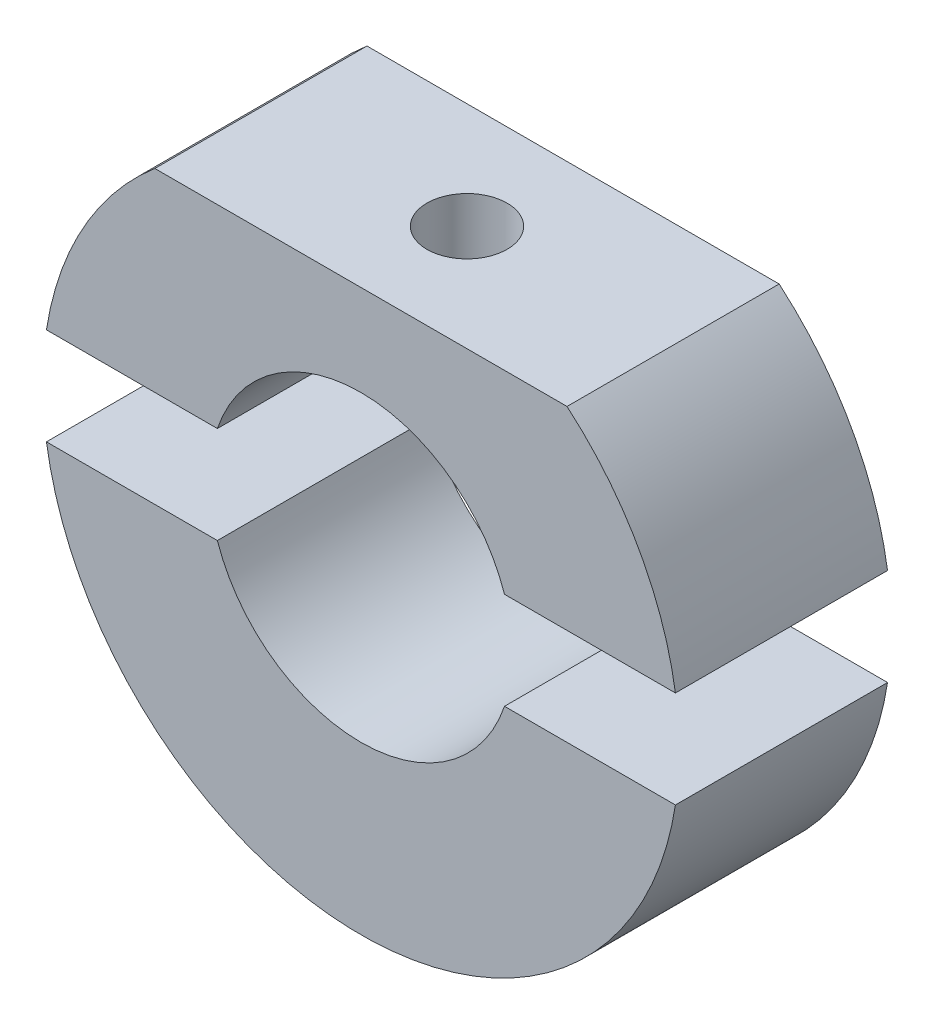
ISO-10303-21;
HEADER;
FILE_DESCRIPTION(('STEP AP214'),'2;1');
FILE_NAME('part.step','',(''),(''),'','','');
FILE_SCHEMA(('AUTOMOTIVE_DESIGN { 1 0 10303 214 1 1 1 1 }'));
ENDSEC;
DATA;
#1=APPLICATION_CONTEXT('core data for automotive mechanical design processes');
#2=APPLICATION_PROTOCOL_DEFINITION('international standard','automotive_design',2000,#1);
#3=PRODUCT_CONTEXT('',#1,'mechanical');
#4=PRODUCT('Part','Part','',(#3));
#5=PRODUCT_RELATED_PRODUCT_CATEGORY('part','',(#4));
#6=PRODUCT_DEFINITION_FORMATION('','',#4);
#7=PRODUCT_DEFINITION_CONTEXT('part definition',#1,'design');
#8=PRODUCT_DEFINITION('design','',#6,#7);
#9=PRODUCT_DEFINITION_SHAPE('','',#8);
#10=(LENGTH_UNIT() NAMED_UNIT(*) SI_UNIT(.MILLI.,.METRE.));
#11=(NAMED_UNIT(*) PLANE_ANGLE_UNIT() SI_UNIT($,.RADIAN.));
#12=(NAMED_UNIT(*) SI_UNIT($,.STERADIAN.) SOLID_ANGLE_UNIT());
#13=UNCERTAINTY_MEASURE_WITH_UNIT(LENGTH_MEASURE(1.E-05),#10,'distance_accuracy_value','');
#14=(GEOMETRIC_REPRESENTATION_CONTEXT(3) GLOBAL_UNCERTAINTY_ASSIGNED_CONTEXT((#13)) GLOBAL_UNIT_ASSIGNED_CONTEXT((#10,
#11,#12)) REPRESENTATION_CONTEXT('',''));
#15=CARTESIAN_POINT('',(0.,0.,0.));
#16=DIRECTION('',(0.,0.,1.));
#17=DIRECTION('',(1.,0.,0.));
#18=AXIS2_PLACEMENT_3D('',#15,#16,#17);
#19=CARTESIAN_POINT('',(0.,-2.54,11.1125));
#20=DIRECTION('',(0.,1.,0.));
#21=DIRECTION('',(0.,0.,1.));
#22=AXIS2_PLACEMENT_3D('',#19,#20,#21);
#23=PLANE('',#22);
#24=DIRECTION('',(1.,0.,0.));
#25=VECTOR('',#24,1.);
#26=CARTESIAN_POINT('',(0.,-2.54,0.));
#27=LINE('',#26,#25);
#28=CARTESIAN_POINT('',(-16.4740895518538,-2.54,0.));
#29=VERTEX_POINT('',#28);
#30=CARTESIAN_POINT('',(-7.52012674427765,-2.54,0.));
#31=VERTEX_POINT('',#30);
#32=EDGE_CURVE('E117',#29,#31,#27,.T.);
#33=ORIENTED_EDGE('',*,*,#32,.F.);
#34=DIRECTION('',(0.,0.,-1.));
#35=VECTOR('',#34,1.);
#36=CARTESIAN_POINT('',(-16.4740895518538,-2.54,11.1125));
#37=LINE('',#36,#35);
#38=CARTESIAN_POINT('',(-16.4740895518538,-2.54,11.1125));
#39=VERTEX_POINT('',#38);
#40=EDGE_CURVE('E12',#39,#29,#37,.T.);
#41=ORIENTED_EDGE('',*,*,#40,.F.);
#42=DIRECTION('',(1.,0.,0.));
#43=VECTOR('',#42,1.);
#44=CARTESIAN_POINT('',(0.,-2.54,11.1125));
#45=LINE('',#44,#43);
#46=CARTESIAN_POINT('',(-7.52012674427765,-2.54,11.1125));
#47=VERTEX_POINT('',#46);
#48=EDGE_CURVE('E99',#39,#47,#45,.T.);
#49=ORIENTED_EDGE('',*,*,#48,.T.);
#50=DIRECTION('',(0.,0.,-1.));
#51=VECTOR('',#50,1.);
#52=CARTESIAN_POINT('',(-7.52012674427765,-2.54,11.1125));
#53=LINE('',#52,#51);
#54=EDGE_CURVE('E67',#47,#31,#53,.T.);
#55=ORIENTED_EDGE('',*,*,#54,.T.);
#56=EDGE_LOOP('',(#33,#41,#49,#55));
#57=FACE_BOUND('',#56,.T.);
#58=ADVANCED_FACE('F50',(#57),#23,.T.);
#59=CARTESIAN_POINT('',(0.,0.,11.1125));
#60=DIRECTION('',(0.,0.,-1.));
#61=DIRECTION('',(-1.,0.,0.));
#62=AXIS2_PLACEMENT_3D('',#59,#60,#61);
#63=CYLINDRICAL_SURFACE('',#62,16.66875);
#64=CARTESIAN_POINT('',(0.,0.,0.));
#65=DIRECTION('',(0.,0.,1.));
#66=DIRECTION('',(1.,0.,0.));
#67=AXIS2_PLACEMENT_3D('',#64,#65,#66);
#68=CIRCLE('',#67,16.66875);
#69=CARTESIAN_POINT('',(16.4740895518538,-2.54,0.));
#70=VERTEX_POINT('',#69);
#71=EDGE_CURVE('E104',#29,#70,#68,.T.);
#72=ORIENTED_EDGE('',*,*,#71,.T.);
#73=DIRECTION('',(0.,0.,-1.));
#74=VECTOR('',#73,1.);
#75=CARTESIAN_POINT('',(16.4740895518538,-2.54,11.1125));
#76=LINE('',#75,#74);
#77=CARTESIAN_POINT('',(16.4740895518538,-2.54,11.1125));
#78=VERTEX_POINT('',#77);
#79=EDGE_CURVE('E59',#78,#70,#76,.T.);
#80=ORIENTED_EDGE('',*,*,#79,.F.);
#81=CARTESIAN_POINT('',(0.,0.,11.1125));
#82=DIRECTION('',(0.,0.,1.));
#83=DIRECTION('',(1.,0.,0.));
#84=AXIS2_PLACEMENT_3D('',#81,#82,#83);
#85=CIRCLE('',#84,16.66875);
#86=EDGE_CURVE('E93',#39,#78,#85,.T.);
#87=ORIENTED_EDGE('',*,*,#86,.F.);
#88=ORIENTED_EDGE('',*,*,#40,.T.);
#89=EDGE_LOOP('',(#72,#80,#87,#88));
#90=FACE_BOUND('',#89,.T.);
#91=ADVANCED_FACE('F52',(#90),#63,.T.);
#92=CARTESIAN_POINT('',(7.52012674427765,-2.54,0.));
#93=VERTEX_POINT('',#92);
#94=EDGE_CURVE('E113',#93,#70,#27,.T.);
#95=ORIENTED_EDGE('',*,*,#94,.F.);
#96=DIRECTION('',(0.,0.,-1.));
#97=VECTOR('',#96,1.);
#98=CARTESIAN_POINT('',(7.52012674427765,-2.54,11.1125));
#99=LINE('',#98,#97);
#100=CARTESIAN_POINT('',(7.52012674427765,-2.54,11.1125));
#101=VERTEX_POINT('',#100);
#102=EDGE_CURVE('E80',#101,#93,#99,.T.);
#103=ORIENTED_EDGE('',*,*,#102,.F.);
#104=EDGE_CURVE('E98',#101,#78,#45,.T.);
#105=ORIENTED_EDGE('',*,*,#104,.T.);
#106=ORIENTED_EDGE('',*,*,#79,.T.);
#107=EDGE_LOOP('',(#95,#103,#105,#106));
#108=FACE_BOUND('',#107,.T.);
#109=ADVANCED_FACE('F107',(#108),#23,.T.);
#110=CARTESIAN_POINT('',(0.,0.,11.1125));
#111=DIRECTION('',(0.,0.,-1.));
#112=DIRECTION('',(-1.,0.,0.));
#113=AXIS2_PLACEMENT_3D('',#110,#111,#112);
#114=CYLINDRICAL_SURFACE('',#113,7.9375);
#115=CARTESIAN_POINT('',(0.,0.,0.));
#116=DIRECTION('',(0.,0.,1.));
#117=DIRECTION('',(1.,0.,0.));
#118=AXIS2_PLACEMENT_3D('',#115,#116,#117);
#119=CIRCLE('',#118,7.9375);
#120=EDGE_CURVE('E111',#31,#93,#119,.T.);
#121=ORIENTED_EDGE('',*,*,#120,.F.);
#122=ORIENTED_EDGE('',*,*,#54,.F.);
#123=CARTESIAN_POINT('',(0.,0.,11.1125));
#124=DIRECTION('',(0.,0.,1.));
#125=DIRECTION('',(1.,0.,0.));
#126=AXIS2_PLACEMENT_3D('',#123,#124,#125);
#127=CIRCLE('',#126,7.9375);
#128=EDGE_CURVE('E108',#47,#101,#127,.T.);
#129=ORIENTED_EDGE('',*,*,#128,.T.);
#130=ORIENTED_EDGE('',*,*,#102,.T.);
#131=EDGE_LOOP('',(#121,#122,#129,#130));
#132=FACE_BOUND('',#131,.T.);
#133=ADVANCED_FACE('F122',(#132),#114,.F.);
#134=CARTESIAN_POINT('',(0.,0.,11.1125));
#135=DIRECTION('',(0.,0.,1.));
#136=DIRECTION('',(1.,0.,0.));
#137=AXIS2_PLACEMENT_3D('',#134,#135,#136);
#138=PLANE('',#137);
#139=ORIENTED_EDGE('',*,*,#48,.F.);
#140=ORIENTED_EDGE('',*,*,#86,.T.);
#141=ORIENTED_EDGE('',*,*,#104,.F.);
#142=ORIENTED_EDGE('',*,*,#128,.F.);
#143=EDGE_LOOP('',(#139,#140,#141,#142));
#144=FACE_BOUND('',#143,.T.);
#145=ADVANCED_FACE('F95',(#144),#138,.T.);
#146=CARTESIAN_POINT('',(0.,0.,0.));
#147=DIRECTION('',(0.,0.,1.));
#148=DIRECTION('',(1.,0.,0.));
#149=AXIS2_PLACEMENT_3D('',#146,#147,#148);
#150=PLANE('',#149);
#151=ORIENTED_EDGE('',*,*,#32,.T.);
#152=ORIENTED_EDGE('',*,*,#120,.T.);
#153=ORIENTED_EDGE('',*,*,#94,.T.);
#154=ORIENTED_EDGE('',*,*,#71,.F.);
#155=EDGE_LOOP('',(#151,#152,#153,#154));
#156=FACE_BOUND('',#155,.T.);
#157=ADVANCED_FACE('F121',(#156),#150,.F.);
#158=CLOSED_SHELL('',(#58,#91,#109,#133,#145,#157));
#159=MANIFOLD_SOLID_BREP('B2',#158);
#160=CARTESIAN_POINT('',(0.,2.54,11.1125));
#161=DIRECTION('',(0.,1.,0.));
#162=DIRECTION('',(0.,0.,1.));
#163=AXIS2_PLACEMENT_3D('',#160,#161,#162);
#164=PLANE('',#163);
#165=DIRECTION('',(1.,0.,0.));
#166=VECTOR('',#165,1.);
#167=CARTESIAN_POINT('',(0.,2.54,0.));
#168=LINE('',#167,#166);
#169=CARTESIAN_POINT('',(7.52012674427765,2.54,0.));
#170=VERTEX_POINT('',#169);
#171=CARTESIAN_POINT('',(16.4740895518538,2.54,0.));
#172=VERTEX_POINT('',#171);
#173=EDGE_CURVE('E262',#170,#172,#168,.T.);
#174=ORIENTED_EDGE('',*,*,#173,.T.);
#175=DIRECTION('',(0.,0.,-1.));
#176=VECTOR('',#175,1.);
#177=CARTESIAN_POINT('',(16.4740895518538,2.54,11.1125));
#178=LINE('',#177,#176);
#179=CARTESIAN_POINT('',(16.4740895518538,2.54,11.1125));
#180=VERTEX_POINT('',#179);
#181=EDGE_CURVE('E48',#180,#172,#178,.T.);
#182=ORIENTED_EDGE('',*,*,#181,.F.);
#183=DIRECTION('',(1.,0.,0.));
#184=VECTOR('',#183,1.);
#185=CARTESIAN_POINT('',(0.,2.54,11.1125));
#186=LINE('',#185,#184);
#187=CARTESIAN_POINT('',(7.52012674427765,2.54,11.1125));
#188=VERTEX_POINT('',#187);
#189=EDGE_CURVE('E252',#188,#180,#186,.T.);
#190=ORIENTED_EDGE('',*,*,#189,.F.);
#191=DIRECTION('',(0.,0.,-1.));
#192=VECTOR('',#191,1.);
#193=CARTESIAN_POINT('',(7.52012674427765,2.54,11.1125));
#194=LINE('',#193,#192);
#195=EDGE_CURVE('E187',#188,#170,#194,.T.);
#196=ORIENTED_EDGE('',*,*,#195,.T.);
#197=EDGE_LOOP('',(#174,#182,#190,#196));
#198=FACE_BOUND('',#197,.T.);
#199=ADVANCED_FACE('F170',(#198),#164,.F.);
#200=CARTESIAN_POINT('',(0.,0.,11.1125));
#201=DIRECTION('',(0.,0.,-1.));
#202=DIRECTION('',(-1.,0.,0.));
#203=AXIS2_PLACEMENT_3D('',#200,#201,#202);
#204=CYLINDRICAL_SURFACE('',#203,16.66875);
#205=CARTESIAN_POINT('',(0.,0.,0.));
#206=DIRECTION('',(0.,0.,1.));
#207=DIRECTION('',(1.,0.,0.));
#208=AXIS2_PLACEMENT_3D('',#205,#206,#207);
#209=CIRCLE('',#208,16.66875);
#210=CARTESIAN_POINT('',(10.7961672163088,12.7,0.));
#211=VERTEX_POINT('',#210);
#212=EDGE_CURVE('E273',#172,#211,#209,.T.);
#213=ORIENTED_EDGE('',*,*,#212,.T.);
#214=DIRECTION('',(0.,0.,-1.));
#215=VECTOR('',#214,1.);
#216=CARTESIAN_POINT('',(10.7961672163088,12.7,11.1125));
#217=LINE('',#216,#215);
#218=CARTESIAN_POINT('',(10.7961672163088,12.7,11.1125));
#219=VERTEX_POINT('',#218);
#220=EDGE_CURVE('E179',#219,#211,#217,.T.);
#221=ORIENTED_EDGE('',*,*,#220,.F.);
#222=CARTESIAN_POINT('',(0.,0.,11.1125));
#223=DIRECTION('',(0.,0.,1.));
#224=DIRECTION('',(1.,0.,0.));
#225=AXIS2_PLACEMENT_3D('',#222,#223,#224);
#226=CIRCLE('',#225,16.66875);
#227=EDGE_CURVE('E220',#180,#219,#226,.T.);
#228=ORIENTED_EDGE('',*,*,#227,.F.);
#229=ORIENTED_EDGE('',*,*,#181,.T.);
#230=EDGE_LOOP('',(#213,#221,#228,#229));
#231=FACE_BOUND('',#230,.T.);
#232=ADVANCED_FACE('F274',(#231),#204,.T.);
#233=CARTESIAN_POINT('',(0.,12.7,11.1125));
#234=DIRECTION('',(0.,1.,0.));
#235=DIRECTION('',(0.,0.,1.));
#236=AXIS2_PLACEMENT_3D('',#233,#234,#235);
#237=PLANE('',#236);
#238=CARTESIAN_POINT('',(0.,12.7,5.55625));
#239=DIRECTION('',(0.,1.,0.));
#240=DIRECTION('',(0.,0.,1.));
#241=AXIS2_PLACEMENT_3D('',#238,#239,#240);
#242=CIRCLE('',#241,2.09999999999999);
#243=CARTESIAN_POINT('',(0.,12.7,7.65624999999999));
#244=VERTEX_POINT('',#243);
#245=EDGE_CURVE('E279',#244,#244,#242,.T.);
#246=ORIENTED_EDGE('',*,*,#245,.F.);
#247=EDGE_LOOP('',(#246));
#248=FACE_BOUND('',#247,.T.);
#249=DIRECTION('',(1.,0.,0.));
#250=VECTOR('',#249,1.);
#251=CARTESIAN_POINT('',(0.,12.7,0.));
#252=LINE('',#251,#250);
#253=CARTESIAN_POINT('',(-10.7961672163088,12.7,0.));
#254=VERTEX_POINT('',#253);
#255=EDGE_CURVE('E265',#254,#211,#252,.T.);
#256=ORIENTED_EDGE('',*,*,#255,.F.);
#257=DIRECTION('',(0.,0.,-1.));
#258=VECTOR('',#257,1.);
#259=CARTESIAN_POINT('',(-10.7961672163088,12.7,11.1125));
#260=LINE('',#259,#258);
#261=CARTESIAN_POINT('',(-10.7961672163088,12.7,11.1125));
#262=VERTEX_POINT('',#261);
#263=EDGE_CURVE('E247',#262,#254,#260,.T.);
#264=ORIENTED_EDGE('',*,*,#263,.F.);
#265=DIRECTION('',(1.,0.,0.));
#266=VECTOR('',#265,1.);
#267=CARTESIAN_POINT('',(0.,12.7,11.1125));
#268=LINE('',#267,#266);
#269=EDGE_CURVE('E237',#262,#219,#268,.T.);
#270=ORIENTED_EDGE('',*,*,#269,.T.);
#271=ORIENTED_EDGE('',*,*,#220,.T.);
#272=EDGE_LOOP('',(#256,#264,#270,#271));
#273=FACE_BOUND('',#272,.T.);
#274=ADVANCED_FACE('F172',(#248,#273),#237,.T.);
#275=CARTESIAN_POINT('',(-16.4740895518538,2.54,0.));
#276=VERTEX_POINT('',#275);
#277=EDGE_CURVE('E244',#254,#276,#209,.T.);
#278=ORIENTED_EDGE('',*,*,#277,.T.);
#279=DIRECTION('',(0.,0.,-1.));
#280=VECTOR('',#279,1.);
#281=CARTESIAN_POINT('',(-16.4740895518538,2.54,11.1125));
#282=LINE('',#281,#280);
#283=CARTESIAN_POINT('',(-16.4740895518538,2.54,11.1125));
#284=VERTEX_POINT('',#283);
#285=EDGE_CURVE('E241',#284,#276,#282,.T.);
#286=ORIENTED_EDGE('',*,*,#285,.F.);
#287=EDGE_CURVE('E230',#262,#284,#226,.T.);
#288=ORIENTED_EDGE('',*,*,#287,.F.);
#289=ORIENTED_EDGE('',*,*,#263,.T.);
#290=EDGE_LOOP('',(#278,#286,#288,#289));
#291=FACE_BOUND('',#290,.T.);
#292=ADVANCED_FACE('F242',(#291),#204,.T.);
#293=CARTESIAN_POINT('',(-7.52012674427765,2.54,0.));
#294=VERTEX_POINT('',#293);
#295=EDGE_CURVE('E258',#276,#294,#168,.T.);
#296=ORIENTED_EDGE('',*,*,#295,.T.);
#297=DIRECTION('',(0.,0.,-1.));
#298=VECTOR('',#297,1.);
#299=CARTESIAN_POINT('',(-7.52012674427765,2.54,11.1125));
#300=LINE('',#299,#298);
#301=CARTESIAN_POINT('',(-7.52012674427765,2.54,11.1125));
#302=VERTEX_POINT('',#301);
#303=EDGE_CURVE('E208',#302,#294,#300,.T.);
#304=ORIENTED_EDGE('',*,*,#303,.F.);
#305=EDGE_CURVE('E235',#284,#302,#186,.T.);
#306=ORIENTED_EDGE('',*,*,#305,.F.);
#307=ORIENTED_EDGE('',*,*,#285,.T.);
#308=EDGE_LOOP('',(#296,#304,#306,#307));
#309=FACE_BOUND('',#308,.T.);
#310=ADVANCED_FACE('F249',(#309),#164,.F.);
#311=CARTESIAN_POINT('',(0.,0.,11.1125));
#312=DIRECTION('',(0.,0.,-1.));
#313=DIRECTION('',(-1.,0.,0.));
#314=AXIS2_PLACEMENT_3D('',#311,#312,#313);
#315=CYLINDRICAL_SURFACE('',#314,7.9375);
#316=CARTESIAN_POINT('',(0.,7.9375,7.65624999999999));
#317=CARTESIAN_POINT('',(-0.115800775870869,7.9374982224611,7.656247182713));
#318=CARTESIAN_POINT('',(-0.231631901545219,7.93494088240058,7.64663943063146));
#319=CARTESIAN_POINT('',(-0.459959589997486,7.92498743496674,7.60852893898243));
#320=CARTESIAN_POINT('',(-0.572454482834371,7.9175889457193,7.58001689830104));
#321=CARTESIAN_POINT('',(-0.790780703324405,7.89877014310864,7.5050880213246));
#322=CARTESIAN_POINT('',(-0.896620346632251,7.88735497117212,7.45869406699579));
#323=CARTESIAN_POINT('',(-1.09901623461956,7.86171038643225,7.34940258797976));
#324=CARTESIAN_POINT('',(-1.19557189887258,7.84748079784377,7.28650403235449));
#325=CARTESIAN_POINT('',(-1.37886558046883,7.81738117590562,7.14447109883935));
#326=CARTESIAN_POINT('',(-1.46536119718838,7.80148345038829,7.06502976349721));
#327=CARTESIAN_POINT('',(-1.62397040605671,7.7700179303843,6.89282263045933));
#328=CARTESIAN_POINT('',(-1.69608217730506,7.75445017789272,6.80005514831466));
#329=CARTESIAN_POINT('',(-1.82505319488354,7.72512450627027,6.60190100139016));
#330=CARTESIAN_POINT('',(-1.88163457463828,7.71140155401098,6.49632783425933));
#331=CARTESIAN_POINT('',(-1.97614929536849,7.68772597418082,6.27674544468114));
#332=CARTESIAN_POINT('',(-2.01408601502361,7.6777726635719,6.16273775500155));
#333=CARTESIAN_POINT('',(-2.06939460574683,7.66304905724432,5.93220469587906));
#334=CARTESIAN_POINT('',(-2.08720549711472,7.65816830832994,5.81579187964805));
#335=CARTESIAN_POINT('',(-2.10312539724365,7.65381236020797,5.58153613459854));
#336=CARTESIAN_POINT('',(-2.1012380249367,7.65433616808405,5.46369347244238));
#337=CARTESIAN_POINT('',(-2.0781637355538,7.66063123608803,5.23334176753199));
#338=CARTESIAN_POINT('',(-2.05750699470787,7.66625833589343,5.12077505236784));
#339=CARTESIAN_POINT('',(-1.99832904337505,7.68189526832685,4.90076480505932));
#340=CARTESIAN_POINT('',(-1.95980642508712,7.69190544633059,4.79332167738094));
#341=CARTESIAN_POINT('',(-1.86555567018734,7.7153081189724,4.58522143412956));
#342=CARTESIAN_POINT('',(-1.80964082373412,7.7287370157663,4.48465314788293));
#343=CARTESIAN_POINT('',(-1.68232312629833,7.75744433313635,4.29413997812111));
#344=CARTESIAN_POINT('',(-1.61091726983126,7.77272311236245,4.20419716134134));
#345=CARTESIAN_POINT('',(-1.45192909356474,7.80400962513754,4.03445777335547));
#346=CARTESIAN_POINT('',(-1.3639012740813,7.82002501878368,3.95507931717628));
#347=CARTESIAN_POINT('',(-1.17558818647016,7.85054032777352,3.81212648354037));
#348=CARTESIAN_POINT('',(-1.07530245036508,7.86504018521852,3.74855270974917));
#349=CARTESIAN_POINT('',(-0.864679369965042,7.8909775734316,3.63883376817395));
#350=CARTESIAN_POINT('',(-0.75430140410168,7.90240192652168,3.59276326117318));
#351=CARTESIAN_POINT('',(-0.526996011707651,7.92080577429267,3.51995212770655));
#352=CARTESIAN_POINT('',(-0.410069998992092,7.92778622447965,3.49320734575163));
#353=CARTESIAN_POINT('',(-0.176556729244425,7.93637165897037,3.46046102096858));
#354=CARTESIAN_POINT('',(-0.0600545016656278,7.93812394644811,3.45389089856722));
#355=CARTESIAN_POINT('',(0.17238684398547,7.93647861379278,3.46011157905352));
#356=CARTESIAN_POINT('',(0.288326018078516,7.93308151698125,3.47290041452914));
#357=CARTESIAN_POINT('',(0.514327748270426,7.92161416615818,3.51700930627612));
#358=CARTESIAN_POINT('',(0.62445644443813,7.91362370890548,3.5480131257709));
#359=CARTESIAN_POINT('',(0.837939680965791,7.89387522598611,3.6273054492413));
#360=CARTESIAN_POINT('',(0.941293491801986,7.88211679538193,3.67559581103679));
#361=CARTESIAN_POINT('',(1.14050926019942,7.85579051151001,3.78915115834636));
#362=CARTESIAN_POINT('',(1.23618746174252,7.84117267996161,3.85472664099925));
#363=CARTESIAN_POINT('',(1.41538171590216,7.81081779740468,4.00059959972844));
#364=CARTESIAN_POINT('',(1.49889539962746,7.79508052928528,4.08089993643096));
#365=CARTESIAN_POINT('',(1.65377911175021,7.76371999502664,4.25659492855708));
#366=CARTESIAN_POINT('',(1.72474826194327,7.74811198647185,4.35234634932688));
#367=CARTESIAN_POINT('',(1.84961873665223,7.71925771767463,4.55472839472228));
#368=CARTESIAN_POINT('',(1.9035207816422,7.70601135774743,4.66135855985916));
#369=CARTESIAN_POINT('',(1.99232118257808,7.68353185502624,4.88193274522574));
#370=CARTESIAN_POINT('',(2.02733010501641,7.67427542794068,4.99582975203821));
#371=CARTESIAN_POINT('',(2.07761629830067,7.66081635591651,5.22817993866695));
#372=CARTESIAN_POINT('',(2.09289851544212,7.65661244412295,5.34663196867778));
#373=CARTESIAN_POINT('',(2.10301627928396,7.65383902864302,5.58062888196051));
#374=CARTESIAN_POINT('',(2.09849566256118,7.65509209780685,5.69614424390153));
#375=CARTESIAN_POINT('',(2.07062697977645,7.66267671640276,5.92470248147602));
#376=CARTESIAN_POINT('',(2.04727938387426,7.66900813901482,6.03774541878012));
#377=CARTESIAN_POINT('',(1.9827900428425,7.68593131608404,6.25735387386675));
#378=CARTESIAN_POINT('',(1.94178270188742,7.69649084958202,6.36396151732478));
#379=CARTESIAN_POINT('',(1.84324250028862,7.72068169363042,6.5688637888854));
#380=CARTESIAN_POINT('',(1.78570708487057,7.73431347899411,6.66715712878828));
#381=CARTESIAN_POINT('',(1.65378399529585,7.76360667520142,6.85571875570497));
#382=CARTESIAN_POINT('',(1.5789560043081,7.77931547980848,6.94567166305166));
#383=CARTESIAN_POINT('',(1.41541193720237,7.81072575249065,7.11195322941151));
#384=CARTESIAN_POINT('',(1.32669250014198,7.8264272178656,7.18827858173911));
#385=CARTESIAN_POINT('',(1.13564038736435,7.85644704881665,7.32670913719499));
#386=CARTESIAN_POINT('',(1.03306139030731,7.87072953400906,7.38848281760726));
#387=CARTESIAN_POINT('',(0.818600904653811,7.89591157312953,7.49381117771153));
#388=CARTESIAN_POINT('',(0.706725533401263,7.90681332969223,7.5373777262947));
#389=CARTESIAN_POINT('',(0.496030648525019,7.92256952650244,7.59927059129889));
#390=CARTESIAN_POINT('',(0.398132135309084,7.92812795917709,7.62058869326469));
#391=CARTESIAN_POINT('',(0.200163167427965,7.93559378987707,7.64907894000752));
#392=CARTESIAN_POINT('',(0.100092921014958,7.93750153642373,7.65625243513466));
#393=CARTESIAN_POINT('',(0.,7.9375,7.65624999999999));
#394=B_SPLINE_CURVE_WITH_KNOTS('',3,(#316,#317,#318,#319,#320,#321,#322,#323,#324,#325,#326,
#327,#328,#329,#330,#331,#332,#333,#334,#335,#336,#337,#338,#339,#340,#341,#342,#343,#344,#345,
#346,#347,#348,#349,#350,#351,#352,#353,#354,#355,#356,#357,#358,#359,#360,#361,#362,#363,#364,
#365,#366,#367,#368,#369,#370,#371,#372,#373,#374,#375,#376,#377,#378,#379,#380,#381,#382,#383,
#384,#385,#386,#387,#388,#389,#390,#391,#392,#393),.UNSPECIFIED.,.T.,.F.,(4,2,2,2,2,2,2,2,2,2,2,
2,2,2,2,2,2,2,2,2,2,2,2,2,2,2,2,2,2,2,2,2,2,2,2,2,2,2,4),(0.,0.347035295305062,
0.694241462548687,1.04100480669828,1.38778981611897,1.7416980445473,2.09565104704003,
2.45557591100914,2.81543552736279,3.16728381640964,3.51906746561635,3.86121311781322,
4.2033857350929,4.54936640886558,4.89541426812045,5.25256466759282,5.60972870645824,
5.96839957833154,6.326993304496,6.67538351470386,7.02373832109094,7.36621683346351,
7.70873216375418,8.05787786781911,8.40709147310291,8.76598703449087,9.12486744337193,
9.48162418446869,9.83829145460504,10.1834502320346,10.5286003901979,10.8711688702458,
11.2137903302403,11.5663475238814,11.9189901485566,12.2790228875209,12.6388205603479,
12.9388107180628,13.2387722350832),.UNSPECIFIED.);
#395=CARTESIAN_POINT('',(0.,7.9375,7.65624999999999));
#396=VERTEX_POINT('',#395);
#397=EDGE_CURVE('E276',#396,#396,#394,.T.);
#398=ORIENTED_EDGE('',*,*,#397,.F.);
#399=EDGE_LOOP('',(#398));
#400=FACE_BOUND('',#399,.T.);
#401=CARTESIAN_POINT('',(0.,0.,0.));
#402=DIRECTION('',(0.,0.,1.));
#403=DIRECTION('',(1.,0.,0.));
#404=AXIS2_PLACEMENT_3D('',#401,#402,#403);
#405=CIRCLE('',#404,7.9375);
#406=EDGE_CURVE('E255',#170,#294,#405,.T.);
#407=ORIENTED_EDGE('',*,*,#406,.F.);
#408=ORIENTED_EDGE('',*,*,#195,.F.);
#409=CARTESIAN_POINT('',(0.,0.,11.1125));
#410=DIRECTION('',(0.,0.,1.));
#411=DIRECTION('',(1.,0.,0.));
#412=AXIS2_PLACEMENT_3D('',#409,#410,#411);
#413=CIRCLE('',#412,7.9375);
#414=EDGE_CURVE('E250',#188,#302,#413,.T.);
#415=ORIENTED_EDGE('',*,*,#414,.T.);
#416=ORIENTED_EDGE('',*,*,#303,.T.);
#417=EDGE_LOOP('',(#407,#408,#415,#416));
#418=FACE_BOUND('',#417,.T.);
#419=ADVANCED_FACE('F306',(#400,#418),#315,.F.);
#420=CARTESIAN_POINT('',(0.,0.,11.1125));
#421=DIRECTION('',(0.,0.,1.));
#422=DIRECTION('',(1.,0.,0.));
#423=AXIS2_PLACEMENT_3D('',#420,#421,#422);
#424=PLANE('',#423);
#425=ORIENTED_EDGE('',*,*,#189,.T.);
#426=ORIENTED_EDGE('',*,*,#227,.T.);
#427=ORIENTED_EDGE('',*,*,#269,.F.);
#428=ORIENTED_EDGE('',*,*,#287,.T.);
#429=ORIENTED_EDGE('',*,*,#305,.T.);
#430=ORIENTED_EDGE('',*,*,#414,.F.);
#431=EDGE_LOOP('',(#425,#426,#427,#428,#429,#430));
#432=FACE_BOUND('',#431,.T.);
#433=ADVANCED_FACE('F232',(#432),#424,.T.);
#434=CARTESIAN_POINT('',(0.,0.,0.));
#435=DIRECTION('',(0.,0.,1.));
#436=DIRECTION('',(1.,0.,0.));
#437=AXIS2_PLACEMENT_3D('',#434,#435,#436);
#438=PLANE('',#437);
#439=ORIENTED_EDGE('',*,*,#173,.F.);
#440=ORIENTED_EDGE('',*,*,#406,.T.);
#441=ORIENTED_EDGE('',*,*,#295,.F.);
#442=ORIENTED_EDGE('',*,*,#277,.F.);
#443=ORIENTED_EDGE('',*,*,#255,.T.);
#444=ORIENTED_EDGE('',*,*,#212,.F.);
#445=EDGE_LOOP('',(#439,#440,#441,#442,#443,#444));
#446=FACE_BOUND('',#445,.T.);
#447=ADVANCED_FACE('F275',(#446),#438,.F.);
#448=CARTESIAN_POINT('',(0.,12.7,5.55625));
#449=DIRECTION('',(0.,1.,0.));
#450=DIRECTION('',(0.,0.,1.));
#451=AXIS2_PLACEMENT_3D('',#448,#449,#450);
#452=CYLINDRICAL_SURFACE('',#451,2.09999999999999);
#453=ORIENTED_EDGE('',*,*,#245,.T.);
#454=EDGE_LOOP('',(#453));
#455=FACE_BOUND('',#454,.T.);
#456=ORIENTED_EDGE('',*,*,#397,.T.);
#457=EDGE_LOOP('',(#456));
#458=FACE_BOUND('',#457,.T.);
#459=ADVANCED_FACE('F291',(#455,#458),#452,.F.);
#460=CLOSED_SHELL('',(#199,#232,#274,#292,#310,#419,#433,#447,#459));
#461=MANIFOLD_SOLID_BREP('B6',#460);
#462=ADVANCED_BREP_SHAPE_REPRESENTATION('',(#18,#159,#461),#14);
#463=SHAPE_DEFINITION_REPRESENTATION(#9,#462);
ENDSEC;
END-ISO-10303-21;
